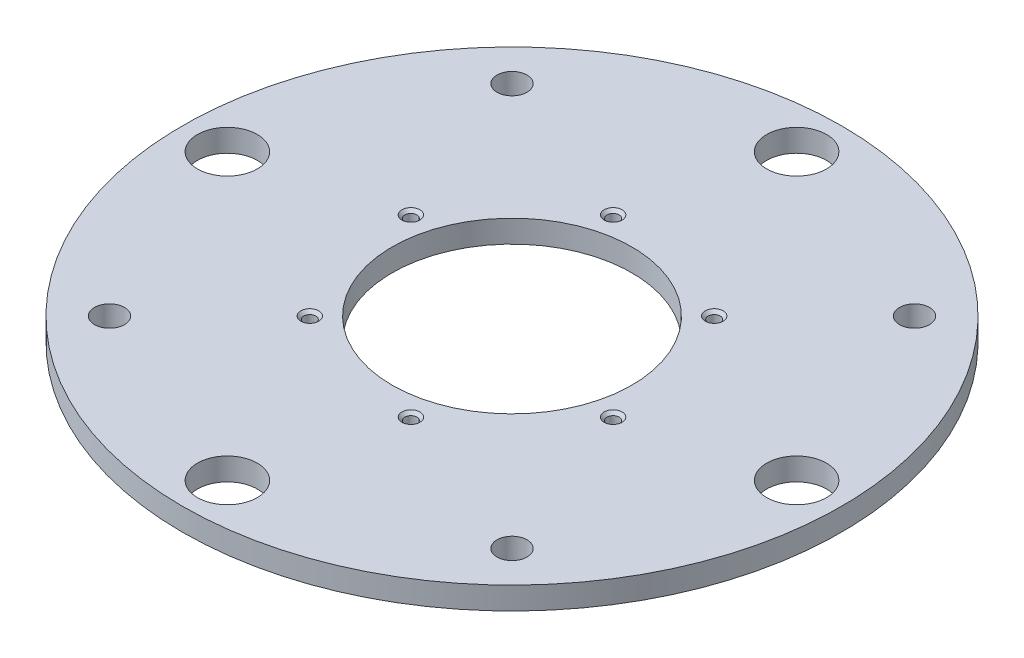
ISO-10303-21;
HEADER;
FILE_DESCRIPTION(('STEP AP214'),'2;1');
FILE_NAME('part.step','',(''),(''),'','','');
FILE_SCHEMA(('AUTOMOTIVE_DESIGN { 1 0 10303 214 1 1 1 1 }'));
ENDSEC;
DATA;
#1=APPLICATION_CONTEXT('core data for automotive mechanical design processes');
#2=APPLICATION_PROTOCOL_DEFINITION('international standard','automotive_design',2000,#1);
#3=PRODUCT_CONTEXT('',#1,'mechanical');
#4=PRODUCT('Part','Part','',(#3));
#5=PRODUCT_RELATED_PRODUCT_CATEGORY('part','',(#4));
#6=PRODUCT_DEFINITION_FORMATION('','',#4);
#7=PRODUCT_DEFINITION_CONTEXT('part definition',#1,'design');
#8=PRODUCT_DEFINITION('design','',#6,#7);
#9=PRODUCT_DEFINITION_SHAPE('','',#8);
#10=(LENGTH_UNIT() NAMED_UNIT(*) SI_UNIT(.MILLI.,.METRE.));
#11=(NAMED_UNIT(*) PLANE_ANGLE_UNIT() SI_UNIT($,.RADIAN.));
#12=(NAMED_UNIT(*) SI_UNIT($,.STERADIAN.) SOLID_ANGLE_UNIT());
#13=UNCERTAINTY_MEASURE_WITH_UNIT(LENGTH_MEASURE(1.E-05),#10,'distance_accuracy_value','');
#14=(GEOMETRIC_REPRESENTATION_CONTEXT(3) GLOBAL_UNCERTAINTY_ASSIGNED_CONTEXT((#13)) GLOBAL_UNIT_ASSIGNED_CONTEXT((#10,
#11,#12)) REPRESENTATION_CONTEXT('',''));
#15=CARTESIAN_POINT('',(0.,0.,0.));
#16=DIRECTION('',(0.,0.,1.));
#17=DIRECTION('',(1.,0.,0.));
#18=AXIS2_PLACEMENT_3D('',#15,#16,#17);
#19=CARTESIAN_POINT('',(0.,9.525,0.));
#20=DIRECTION('',(0.,1.,0.));
#21=DIRECTION('',(0.,0.,1.));
#22=AXIS2_PLACEMENT_3D('',#19,#20,#21);
#23=PLANE('',#22);
#24=CARTESIAN_POINT('',(-58.5454887757494,9.525,-15.6872164379448));
#25=DIRECTION('',(0.,1.,0.));
#26=DIRECTION('',(0.,0.,1.));
#27=AXIS2_PLACEMENT_3D('',#24,#25,#26);
#28=CIRCLE('',#27,3.81);
#29=CARTESIAN_POINT('',(-58.5454887757494,9.525,-11.8772164379448));
#30=VERTEX_POINT('',#29);
#31=EDGE_CURVE('E167',#30,#30,#28,.T.);
#32=ORIENTED_EDGE('',*,*,#31,.F.);
#33=EDGE_LOOP('',(#32));
#34=FACE_BOUND('',#33,.T.);
#35=CARTESIAN_POINT('',(-15.6872164379468,9.525,-58.5454887757503));
#36=DIRECTION('',(0.,1.,0.));
#37=DIRECTION('',(0.,0.,1.));
#38=AXIS2_PLACEMENT_3D('',#35,#36,#37);
#39=CIRCLE('',#38,3.81);
#40=CARTESIAN_POINT('',(-15.6872164379468,9.525,-54.7354887757503));
#41=VERTEX_POINT('',#40);
#42=EDGE_CURVE('E155',#41,#41,#39,.T.);
#43=ORIENTED_EDGE('',*,*,#42,.F.);
#44=EDGE_LOOP('',(#43));
#45=FACE_BOUND('',#44,.T.);
#46=CARTESIAN_POINT('',(42.8582723378026,9.525,-42.8582723378025));
#47=DIRECTION('',(0.,1.,0.));
#48=DIRECTION('',(0.,0.,1.));
#49=AXIS2_PLACEMENT_3D('',#46,#47,#48);
#50=CIRCLE('',#49,3.81);
#51=CARTESIAN_POINT('',(42.8582723378026,9.525,-39.0482723378025));
#52=VERTEX_POINT('',#51);
#53=EDGE_CURVE('E143',#52,#52,#50,.T.);
#54=ORIENTED_EDGE('',*,*,#53,.F.);
#55=EDGE_LOOP('',(#54));
#56=FACE_BOUND('',#55,.T.);
#57=CARTESIAN_POINT('',(58.5454887757501,9.525,15.6872164379478));
#58=DIRECTION('',(0.,1.,0.));
#59=DIRECTION('',(0.,0.,1.));
#60=AXIS2_PLACEMENT_3D('',#57,#58,#59);
#61=CIRCLE('',#60,3.81);
#62=CARTESIAN_POINT('',(58.5454887757501,9.525,19.4972164379478));
#63=VERTEX_POINT('',#62);
#64=EDGE_CURVE('E131',#63,#63,#61,.T.);
#65=ORIENTED_EDGE('',*,*,#64,.F.);
#66=EDGE_LOOP('',(#65));
#67=FACE_BOUND('',#66,.T.);
#68=CARTESIAN_POINT('',(15.6872164379472,9.525,58.5454887757502));
#69=DIRECTION('',(0.,1.,0.));
#70=DIRECTION('',(0.,0.,1.));
#71=AXIS2_PLACEMENT_3D('',#68,#69,#70);
#72=CIRCLE('',#71,3.81);
#73=CARTESIAN_POINT('',(15.6872164379472,9.525,62.3554887757502));
#74=VERTEX_POINT('',#73);
#75=EDGE_CURVE('E119',#74,#74,#72,.T.);
#76=ORIENTED_EDGE('',*,*,#75,.F.);
#77=EDGE_LOOP('',(#76));
#78=FACE_BOUND('',#77,.T.);
#79=CARTESIAN_POINT('',(-42.8582723378026,9.525,42.8582723378025));
#80=DIRECTION('',(0.,1.,0.));
#81=DIRECTION('',(0.,0.,1.));
#82=AXIS2_PLACEMENT_3D('',#79,#80,#81);
#83=CIRCLE('',#82,3.81);
#84=CARTESIAN_POINT('',(-42.8582723378026,9.525,46.6682723378025));
#85=VERTEX_POINT('',#84);
#86=EDGE_CURVE('E107',#85,#85,#83,.T.);
#87=ORIENTED_EDGE('',*,*,#86,.F.);
#88=EDGE_LOOP('',(#87));
#89=FACE_BOUND('',#88,.T.);
#90=CARTESIAN_POINT('',(-85.3124331501554,9.525,-85.3124331501519));
#91=DIRECTION('',(0.,1.,0.));
#92=DIRECTION('',(0.,0.,1.));
#93=AXIS2_PLACEMENT_3D('',#90,#91,#92);
#94=CIRCLE('',#93,6.34999999999999);
#95=CARTESIAN_POINT('',(-85.3124331501554,9.525,-78.962433150152));
#96=VERTEX_POINT('',#95);
#97=EDGE_CURVE('E57',#96,#96,#94,.T.);
#98=ORIENTED_EDGE('',*,*,#97,.F.);
#99=EDGE_LOOP('',(#98));
#100=FACE_BOUND('',#99,.T.);
#101=CARTESIAN_POINT('',(0.,9.525,-120.65));
#102=DIRECTION('',(0.,1.,0.));
#103=DIRECTION('',(0.,0.,1.));
#104=AXIS2_PLACEMENT_3D('',#101,#102,#103);
#105=CIRCLE('',#104,12.6746);
#106=CARTESIAN_POINT('',(0.,9.525,-107.9754));
#107=VERTEX_POINT('',#106);
#108=EDGE_CURVE('E94',#107,#107,#105,.T.);
#109=ORIENTED_EDGE('',*,*,#108,.F.);
#110=EDGE_LOOP('',(#109));
#111=FACE_BOUND('',#110,.T.);
#112=CARTESIAN_POINT('',(85.3124331501571,9.525,-85.3124331501568));
#113=DIRECTION('',(0.,1.,0.));
#114=DIRECTION('',(0.,0.,1.));
#115=AXIS2_PLACEMENT_3D('',#112,#113,#114);
#116=CIRCLE('',#115,6.34999999999999);
#117=CARTESIAN_POINT('',(85.3124331501571,9.525,-78.9624331501568));
#118=VERTEX_POINT('',#117);
#119=EDGE_CURVE('E88',#118,#118,#116,.T.);
#120=ORIENTED_EDGE('',*,*,#119,.F.);
#121=EDGE_LOOP('',(#120));
#122=FACE_BOUND('',#121,.T.);
#123=CARTESIAN_POINT('',(120.65,9.525,0.));
#124=DIRECTION('',(0.,1.,0.));
#125=DIRECTION('',(0.,0.,1.));
#126=AXIS2_PLACEMENT_3D('',#123,#124,#125);
#127=CIRCLE('',#126,12.6746);
#128=CARTESIAN_POINT('',(120.65,9.525,12.6746));
#129=VERTEX_POINT('',#128);
#130=EDGE_CURVE('E82',#129,#129,#127,.T.);
#131=ORIENTED_EDGE('',*,*,#130,.F.);
#132=EDGE_LOOP('',(#131));
#133=FACE_BOUND('',#132,.T.);
#134=CARTESIAN_POINT('',(85.312433150162,9.525,85.3124331501558));
#135=DIRECTION('',(0.,1.,0.));
#136=DIRECTION('',(0.,0.,1.));
#137=AXIS2_PLACEMENT_3D('',#134,#135,#136);
#138=CIRCLE('',#137,6.35000000000011);
#139=CARTESIAN_POINT('',(85.312433150162,9.525,91.6624331501559));
#140=VERTEX_POINT('',#139);
#141=EDGE_CURVE('E76',#140,#140,#138,.T.);
#142=ORIENTED_EDGE('',*,*,#141,.F.);
#143=EDGE_LOOP('',(#142));
#144=FACE_BOUND('',#143,.T.);
#145=CARTESIAN_POINT('',(0.,9.525,120.65));
#146=DIRECTION('',(0.,1.,0.));
#147=DIRECTION('',(0.,0.,1.));
#148=AXIS2_PLACEMENT_3D('',#145,#146,#147);
#149=CIRCLE('',#148,12.6746);
#150=CARTESIAN_POINT('',(0.,9.525,133.3246));
#151=VERTEX_POINT('',#150);
#152=EDGE_CURVE('E70',#151,#151,#149,.T.);
#153=ORIENTED_EDGE('',*,*,#152,.F.);
#154=EDGE_LOOP('',(#153));
#155=FACE_BOUND('',#154,.T.);
#156=CARTESIAN_POINT('',(-85.3124331501506,9.525,85.3124331501606));
#157=DIRECTION('',(0.,1.,0.));
#158=DIRECTION('',(0.,0.,1.));
#159=AXIS2_PLACEMENT_3D('',#156,#157,#158);
#160=CIRCLE('',#159,6.34999999999999);
#161=CARTESIAN_POINT('',(-85.3124331501506,9.525,91.6624331501606));
#162=VERTEX_POINT('',#161);
#163=EDGE_CURVE('E63',#162,#162,#160,.T.);
#164=ORIENTED_EDGE('',*,*,#163,.F.);
#165=EDGE_LOOP('',(#164));
#166=FACE_BOUND('',#165,.T.);
#167=CARTESIAN_POINT('',(-120.65,9.525,0.));
#168=DIRECTION('',(0.,1.,0.));
#169=DIRECTION('',(0.,0.,1.));
#170=AXIS2_PLACEMENT_3D('',#167,#168,#169);
#171=CIRCLE('',#170,12.6746);
#172=CARTESIAN_POINT('',(-120.65,9.525,12.6746));
#173=VERTEX_POINT('',#172);
#174=EDGE_CURVE('E54',#173,#173,#171,.T.);
#175=ORIENTED_EDGE('',*,*,#174,.F.);
#176=EDGE_LOOP('',(#175));
#177=FACE_BOUND('',#176,.T.);
#178=CARTESIAN_POINT('',(0.,9.525,0.));
#179=DIRECTION('',(0.,1.,0.));
#180=DIRECTION('',(0.,0.,1.));
#181=AXIS2_PLACEMENT_3D('',#178,#179,#180);
#182=CIRCLE('',#181,139.7);
#183=CARTESIAN_POINT('',(0.,9.525,139.7));
#184=VERTEX_POINT('',#183);
#185=EDGE_CURVE('E10',#184,#184,#182,.T.);
#186=ORIENTED_EDGE('',*,*,#185,.T.);
#187=EDGE_LOOP('',(#186));
#188=FACE_BOUND('',#187,.T.);
#189=CARTESIAN_POINT('',(0.,9.525,0.));
#190=DIRECTION('',(0.,1.,0.));
#191=DIRECTION('',(0.,0.,1.));
#192=AXIS2_PLACEMENT_3D('',#189,#190,#191);
#193=CIRCLE('',#192,50.8);
#194=CARTESIAN_POINT('',(0.,9.525,50.8));
#195=VERTEX_POINT('',#194);
#196=EDGE_CURVE('E46',#195,#195,#193,.T.);
#197=ORIENTED_EDGE('',*,*,#196,.F.);
#198=EDGE_LOOP('',(#197));
#199=FACE_BOUND('',#198,.T.);
#200=ADVANCED_FACE('F35',(#34,#45,#56,#67,#78,#89,#100,#111,#122,#133,#144,#155,#166,#177,#188,
#199),#23,.T.);
#201=CARTESIAN_POINT('',(0.,0.,0.));
#202=DIRECTION('',(0.,1.,0.));
#203=DIRECTION('',(0.,0.,1.));
#204=AXIS2_PLACEMENT_3D('',#201,#202,#203);
#205=PLANE('',#204);
#206=CARTESIAN_POINT('',(-58.5454887757494,0.,-15.6872164379448));
#207=DIRECTION('',(0.,1.,0.));
#208=DIRECTION('',(0.,0.,1.));
#209=AXIS2_PLACEMENT_3D('',#206,#207,#208);
#210=CIRCLE('',#209,3.80999999999999);
#211=CARTESIAN_POINT('',(-58.5454887757494,0.,-11.8772164379448));
#212=VERTEX_POINT('',#211);
#213=EDGE_CURVE('E170',#212,#212,#210,.T.);
#214=ORIENTED_EDGE('',*,*,#213,.T.);
#215=EDGE_LOOP('',(#214));
#216=FACE_BOUND('',#215,.T.);
#217=CARTESIAN_POINT('',(-15.6872164379468,0.,-58.5454887757503));
#218=DIRECTION('',(0.,1.,0.));
#219=DIRECTION('',(0.,0.,1.));
#220=AXIS2_PLACEMENT_3D('',#217,#218,#219);
#221=CIRCLE('',#220,3.81);
#222=CARTESIAN_POINT('',(-15.6872164379468,0.,-54.7354887757503));
#223=VERTEX_POINT('',#222);
#224=EDGE_CURVE('E158',#223,#223,#221,.T.);
#225=ORIENTED_EDGE('',*,*,#224,.T.);
#226=EDGE_LOOP('',(#225));
#227=FACE_BOUND('',#226,.T.);
#228=CARTESIAN_POINT('',(42.8582723378026,0.,-42.8582723378025));
#229=DIRECTION('',(0.,1.,0.));
#230=DIRECTION('',(0.,0.,1.));
#231=AXIS2_PLACEMENT_3D('',#228,#229,#230);
#232=CIRCLE('',#231,3.81);
#233=CARTESIAN_POINT('',(42.8582723378026,0.,-39.0482723378025));
#234=VERTEX_POINT('',#233);
#235=EDGE_CURVE('E146',#234,#234,#232,.T.);
#236=ORIENTED_EDGE('',*,*,#235,.T.);
#237=EDGE_LOOP('',(#236));
#238=FACE_BOUND('',#237,.T.);
#239=CARTESIAN_POINT('',(58.5454887757501,0.,15.6872164379478));
#240=DIRECTION('',(0.,1.,0.));
#241=DIRECTION('',(0.,0.,1.));
#242=AXIS2_PLACEMENT_3D('',#239,#240,#241);
#243=CIRCLE('',#242,3.80999999999999);
#244=CARTESIAN_POINT('',(58.5454887757501,0.,19.4972164379478));
#245=VERTEX_POINT('',#244);
#246=EDGE_CURVE('E134',#245,#245,#243,.T.);
#247=ORIENTED_EDGE('',*,*,#246,.T.);
#248=EDGE_LOOP('',(#247));
#249=FACE_BOUND('',#248,.T.);
#250=CARTESIAN_POINT('',(15.6872164379472,0.,58.5454887757502));
#251=DIRECTION('',(0.,1.,0.));
#252=DIRECTION('',(0.,0.,1.));
#253=AXIS2_PLACEMENT_3D('',#250,#251,#252);
#254=CIRCLE('',#253,3.81);
#255=CARTESIAN_POINT('',(15.6872164379472,0.,62.3554887757502));
#256=VERTEX_POINT('',#255);
#257=EDGE_CURVE('E122',#256,#256,#254,.T.);
#258=ORIENTED_EDGE('',*,*,#257,.T.);
#259=EDGE_LOOP('',(#258));
#260=FACE_BOUND('',#259,.T.);
#261=CARTESIAN_POINT('',(-42.8582723378026,0.,42.8582723378025));
#262=DIRECTION('',(0.,1.,0.));
#263=DIRECTION('',(0.,0.,1.));
#264=AXIS2_PLACEMENT_3D('',#261,#262,#263);
#265=CIRCLE('',#264,3.81);
#266=CARTESIAN_POINT('',(-42.8582723378026,0.,46.6682723378025));
#267=VERTEX_POINT('',#266);
#268=EDGE_CURVE('E110',#267,#267,#265,.T.);
#269=ORIENTED_EDGE('',*,*,#268,.T.);
#270=EDGE_LOOP('',(#269));
#271=FACE_BOUND('',#270,.T.);
#272=CARTESIAN_POINT('',(-85.3124331501554,0.,-85.3124331501519));
#273=DIRECTION('',(0.,1.,0.));
#274=DIRECTION('',(0.,0.,1.));
#275=AXIS2_PLACEMENT_3D('',#272,#273,#274);
#276=CIRCLE('',#275,6.34999999999999);
#277=CARTESIAN_POINT('',(-85.3124331501554,0.,-78.962433150152));
#278=VERTEX_POINT('',#277);
#279=EDGE_CURVE('E97',#278,#278,#276,.T.);
#280=ORIENTED_EDGE('',*,*,#279,.T.);
#281=EDGE_LOOP('',(#280));
#282=FACE_BOUND('',#281,.T.);
#283=CARTESIAN_POINT('',(0.,0.,-120.65));
#284=DIRECTION('',(0.,1.,0.));
#285=DIRECTION('',(0.,0.,1.));
#286=AXIS2_PLACEMENT_3D('',#283,#284,#285);
#287=CIRCLE('',#286,12.6746);
#288=CARTESIAN_POINT('',(0.,0.,-107.9754));
#289=VERTEX_POINT('',#288);
#290=EDGE_CURVE('E91',#289,#289,#287,.T.);
#291=ORIENTED_EDGE('',*,*,#290,.T.);
#292=EDGE_LOOP('',(#291));
#293=FACE_BOUND('',#292,.T.);
#294=CARTESIAN_POINT('',(85.3124331501571,0.,-85.3124331501568));
#295=DIRECTION('',(0.,1.,0.));
#296=DIRECTION('',(0.,0.,1.));
#297=AXIS2_PLACEMENT_3D('',#294,#295,#296);
#298=CIRCLE('',#297,6.34999999999999);
#299=CARTESIAN_POINT('',(85.3124331501571,0.,-78.9624331501568));
#300=VERTEX_POINT('',#299);
#301=EDGE_CURVE('E85',#300,#300,#298,.T.);
#302=ORIENTED_EDGE('',*,*,#301,.T.);
#303=EDGE_LOOP('',(#302));
#304=FACE_BOUND('',#303,.T.);
#305=CARTESIAN_POINT('',(120.65,0.,0.));
#306=DIRECTION('',(0.,1.,0.));
#307=DIRECTION('',(0.,0.,1.));
#308=AXIS2_PLACEMENT_3D('',#305,#306,#307);
#309=CIRCLE('',#308,12.6746);
#310=CARTESIAN_POINT('',(120.65,0.,12.6746));
#311=VERTEX_POINT('',#310);
#312=EDGE_CURVE('E79',#311,#311,#309,.T.);
#313=ORIENTED_EDGE('',*,*,#312,.T.);
#314=EDGE_LOOP('',(#313));
#315=FACE_BOUND('',#314,.T.);
#316=CARTESIAN_POINT('',(85.312433150162,0.,85.3124331501558));
#317=DIRECTION('',(0.,1.,0.));
#318=DIRECTION('',(0.,0.,1.));
#319=AXIS2_PLACEMENT_3D('',#316,#317,#318);
#320=CIRCLE('',#319,6.35000000000011);
#321=CARTESIAN_POINT('',(85.312433150162,0.,91.6624331501559));
#322=VERTEX_POINT('',#321);
#323=EDGE_CURVE('E73',#322,#322,#320,.T.);
#324=ORIENTED_EDGE('',*,*,#323,.T.);
#325=EDGE_LOOP('',(#324));
#326=FACE_BOUND('',#325,.T.);
#327=CARTESIAN_POINT('',(0.,0.,120.65));
#328=DIRECTION('',(0.,1.,0.));
#329=DIRECTION('',(0.,0.,1.));
#330=AXIS2_PLACEMENT_3D('',#327,#328,#329);
#331=CIRCLE('',#330,12.6746);
#332=CARTESIAN_POINT('',(0.,0.,133.3246));
#333=VERTEX_POINT('',#332);
#334=EDGE_CURVE('E67',#333,#333,#331,.T.);
#335=ORIENTED_EDGE('',*,*,#334,.T.);
#336=EDGE_LOOP('',(#335));
#337=FACE_BOUND('',#336,.T.);
#338=CARTESIAN_POINT('',(-85.3124331501506,0.,85.3124331501606));
#339=DIRECTION('',(0.,1.,0.));
#340=DIRECTION('',(0.,0.,1.));
#341=AXIS2_PLACEMENT_3D('',#338,#339,#340);
#342=CIRCLE('',#341,6.34999999999999);
#343=CARTESIAN_POINT('',(-85.3124331501506,0.,91.6624331501606));
#344=VERTEX_POINT('',#343);
#345=EDGE_CURVE('E60',#344,#344,#342,.T.);
#346=ORIENTED_EDGE('',*,*,#345,.T.);
#347=EDGE_LOOP('',(#346));
#348=FACE_BOUND('',#347,.T.);
#349=CARTESIAN_POINT('',(-120.65,0.,0.));
#350=DIRECTION('',(0.,1.,0.));
#351=DIRECTION('',(0.,0.,1.));
#352=AXIS2_PLACEMENT_3D('',#349,#350,#351);
#353=CIRCLE('',#352,12.6746);
#354=CARTESIAN_POINT('',(-120.65,0.,12.6746));
#355=VERTEX_POINT('',#354);
#356=EDGE_CURVE('E51',#355,#355,#353,.T.);
#357=ORIENTED_EDGE('',*,*,#356,.T.);
#358=EDGE_LOOP('',(#357));
#359=FACE_BOUND('',#358,.T.);
#360=CARTESIAN_POINT('',(0.,0.,0.));
#361=DIRECTION('',(0.,1.,0.));
#362=DIRECTION('',(0.,0.,1.));
#363=AXIS2_PLACEMENT_3D('',#360,#361,#362);
#364=CIRCLE('',#363,139.7);
#365=CARTESIAN_POINT('',(0.,0.,139.7));
#366=VERTEX_POINT('',#365);
#367=EDGE_CURVE('E39',#366,#366,#364,.T.);
#368=ORIENTED_EDGE('',*,*,#367,.F.);
#369=EDGE_LOOP('',(#368));
#370=FACE_BOUND('',#369,.T.);
#371=CARTESIAN_POINT('',(0.,0.,0.));
#372=DIRECTION('',(0.,1.,0.));
#373=DIRECTION('',(0.,0.,1.));
#374=AXIS2_PLACEMENT_3D('',#371,#372,#373);
#375=CIRCLE('',#374,50.8);
#376=CARTESIAN_POINT('',(0.,0.,50.8));
#377=VERTEX_POINT('',#376);
#378=EDGE_CURVE('E48',#377,#377,#375,.T.);
#379=ORIENTED_EDGE('',*,*,#378,.T.);
#380=EDGE_LOOP('',(#379));
#381=FACE_BOUND('',#380,.T.);
#382=ADVANCED_FACE('F174',(#216,#227,#238,#249,#260,#271,#282,#293,#304,#315,#326,#337,#348,
#359,#370,#381),#205,.F.);
#383=CARTESIAN_POINT('',(0.,9.525,0.));
#384=DIRECTION('',(0.,-1.,0.));
#385=DIRECTION('',(0.,0.,-1.));
#386=AXIS2_PLACEMENT_3D('',#383,#384,#385);
#387=CYLINDRICAL_SURFACE('',#386,139.7);
#388=ORIENTED_EDGE('',*,*,#185,.F.);
#389=EDGE_LOOP('',(#388));
#390=FACE_BOUND('',#389,.T.);
#391=ORIENTED_EDGE('',*,*,#367,.T.);
#392=EDGE_LOOP('',(#391));
#393=FACE_BOUND('',#392,.T.);
#394=ADVANCED_FACE('F37',(#390,#393),#387,.T.);
#395=CARTESIAN_POINT('',(0.,9.525,0.));
#396=DIRECTION('',(0.,-1.,0.));
#397=DIRECTION('',(0.,0.,-1.));
#398=AXIS2_PLACEMENT_3D('',#395,#396,#397);
#399=CYLINDRICAL_SURFACE('',#398,50.8);
#400=ORIENTED_EDGE('',*,*,#196,.T.);
#401=EDGE_LOOP('',(#400));
#402=FACE_BOUND('',#401,.T.);
#403=ORIENTED_EDGE('',*,*,#378,.F.);
#404=EDGE_LOOP('',(#403));
#405=FACE_BOUND('',#404,.T.);
#406=ADVANCED_FACE('F227',(#402,#405),#399,.F.);
#407=CARTESIAN_POINT('',(-120.65,0.,0.));
#408=DIRECTION('',(0.,1.,0.));
#409=DIRECTION('',(0.,0.,1.));
#410=AXIS2_PLACEMENT_3D('',#407,#408,#409);
#411=CYLINDRICAL_SURFACE('',#410,12.6746);
#412=ORIENTED_EDGE('',*,*,#356,.F.);
#413=EDGE_LOOP('',(#412));
#414=FACE_BOUND('',#413,.T.);
#415=ORIENTED_EDGE('',*,*,#174,.T.);
#416=EDGE_LOOP('',(#415));
#417=FACE_BOUND('',#416,.T.);
#418=ADVANCED_FACE('F230',(#414,#417),#411,.F.);
#419=CARTESIAN_POINT('',(-85.3124331501506,0.,85.3124331501606));
#420=DIRECTION('',(0.,1.,0.));
#421=DIRECTION('',(0.,0.,1.));
#422=AXIS2_PLACEMENT_3D('',#419,#420,#421);
#423=CYLINDRICAL_SURFACE('',#422,6.34999999999999);
#424=ORIENTED_EDGE('',*,*,#345,.F.);
#425=EDGE_LOOP('',(#424));
#426=FACE_BOUND('',#425,.T.);
#427=ORIENTED_EDGE('',*,*,#163,.T.);
#428=EDGE_LOOP('',(#427));
#429=FACE_BOUND('',#428,.T.);
#430=ADVANCED_FACE('F242',(#426,#429),#423,.F.);
#431=CARTESIAN_POINT('',(0.,0.,120.65));
#432=DIRECTION('',(0.,1.,0.));
#433=DIRECTION('',(0.,0.,1.));
#434=AXIS2_PLACEMENT_3D('',#431,#432,#433);
#435=CYLINDRICAL_SURFACE('',#434,12.6746);
#436=ORIENTED_EDGE('',*,*,#334,.F.);
#437=EDGE_LOOP('',(#436));
#438=FACE_BOUND('',#437,.T.);
#439=ORIENTED_EDGE('',*,*,#152,.T.);
#440=EDGE_LOOP('',(#439));
#441=FACE_BOUND('',#440,.T.);
#442=ADVANCED_FACE('F246',(#438,#441),#435,.F.);
#443=CARTESIAN_POINT('',(85.312433150162,0.,85.3124331501558));
#444=DIRECTION('',(0.,1.,0.));
#445=DIRECTION('',(0.,0.,1.));
#446=AXIS2_PLACEMENT_3D('',#443,#444,#445);
#447=CYLINDRICAL_SURFACE('',#446,6.35000000000011);
#448=ORIENTED_EDGE('',*,*,#323,.F.);
#449=EDGE_LOOP('',(#448));
#450=FACE_BOUND('',#449,.T.);
#451=ORIENTED_EDGE('',*,*,#141,.T.);
#452=EDGE_LOOP('',(#451));
#453=FACE_BOUND('',#452,.T.);
#454=ADVANCED_FACE('F250',(#450,#453),#447,.F.);
#455=CARTESIAN_POINT('',(120.65,0.,0.));
#456=DIRECTION('',(0.,1.,0.));
#457=DIRECTION('',(0.,0.,1.));
#458=AXIS2_PLACEMENT_3D('',#455,#456,#457);
#459=CYLINDRICAL_SURFACE('',#458,12.6746);
#460=ORIENTED_EDGE('',*,*,#312,.F.);
#461=EDGE_LOOP('',(#460));
#462=FACE_BOUND('',#461,.T.);
#463=ORIENTED_EDGE('',*,*,#130,.T.);
#464=EDGE_LOOP('',(#463));
#465=FACE_BOUND('',#464,.T.);
#466=ADVANCED_FACE('F254',(#462,#465),#459,.F.);
#467=CARTESIAN_POINT('',(85.3124331501571,0.,-85.3124331501568));
#468=DIRECTION('',(0.,1.,0.));
#469=DIRECTION('',(0.,0.,1.));
#470=AXIS2_PLACEMENT_3D('',#467,#468,#469);
#471=CYLINDRICAL_SURFACE('',#470,6.34999999999999);
#472=ORIENTED_EDGE('',*,*,#301,.F.);
#473=EDGE_LOOP('',(#472));
#474=FACE_BOUND('',#473,.T.);
#475=ORIENTED_EDGE('',*,*,#119,.T.);
#476=EDGE_LOOP('',(#475));
#477=FACE_BOUND('',#476,.T.);
#478=ADVANCED_FACE('F258',(#474,#477),#471,.F.);
#479=CARTESIAN_POINT('',(0.,0.,-120.65));
#480=DIRECTION('',(0.,1.,0.));
#481=DIRECTION('',(0.,0.,1.));
#482=AXIS2_PLACEMENT_3D('',#479,#480,#481);
#483=CYLINDRICAL_SURFACE('',#482,12.6746);
#484=ORIENTED_EDGE('',*,*,#290,.F.);
#485=EDGE_LOOP('',(#484));
#486=FACE_BOUND('',#485,.T.);
#487=ORIENTED_EDGE('',*,*,#108,.T.);
#488=EDGE_LOOP('',(#487));
#489=FACE_BOUND('',#488,.T.);
#490=ADVANCED_FACE('F262',(#486,#489),#483,.F.);
#491=CARTESIAN_POINT('',(-85.3124331501554,0.,-85.3124331501519));
#492=DIRECTION('',(0.,1.,0.));
#493=DIRECTION('',(0.,0.,1.));
#494=AXIS2_PLACEMENT_3D('',#491,#492,#493);
#495=CYLINDRICAL_SURFACE('',#494,6.34999999999999);
#496=ORIENTED_EDGE('',*,*,#279,.F.);
#497=EDGE_LOOP('',(#496));
#498=FACE_BOUND('',#497,.T.);
#499=ORIENTED_EDGE('',*,*,#97,.T.);
#500=EDGE_LOOP('',(#499));
#501=FACE_BOUND('',#500,.T.);
#502=ADVANCED_FACE('F266',(#498,#501),#495,.F.);
#503=CARTESIAN_POINT('',(-42.8582723378026,1.2573,42.8582723378025));
#504=DIRECTION('',(0.,-1.,0.));
#505=DIRECTION('',(0.,0.,-1.));
#506=AXIS2_PLACEMENT_3D('',#503,#504,#505);
#507=CONICAL_SURFACE('',#506,2.5527,0.785398163397448);
#508=ORIENTED_EDGE('',*,*,#268,.F.);
#509=EDGE_LOOP('',(#508));
#510=FACE_BOUND('',#509,.T.);
#511=CARTESIAN_POINT('',(-42.8582723378026,1.2573,42.8582723378025));
#512=DIRECTION('',(0.,1.,0.));
#513=DIRECTION('',(0.,0.,1.));
#514=AXIS2_PLACEMENT_3D('',#511,#512,#513);
#515=CIRCLE('',#514,2.5527);
#516=CARTESIAN_POINT('',(-42.8582723378026,1.2573,45.4109723378025));
#517=VERTEX_POINT('',#516);
#518=EDGE_CURVE('E64',#517,#517,#515,.T.);
#519=ORIENTED_EDGE('',*,*,#518,.T.);
#520=EDGE_LOOP('',(#519));
#521=FACE_BOUND('',#520,.T.);
#522=ADVANCED_FACE('F270',(#510,#521),#507,.F.);
#523=CARTESIAN_POINT('',(-42.8582723378026,9.525,42.8582723378025));
#524=DIRECTION('',(0.,1.,0.));
#525=DIRECTION('',(0.,0.,1.));
#526=AXIS2_PLACEMENT_3D('',#523,#524,#525);
#527=CYLINDRICAL_SURFACE('',#526,2.5527);
#528=ORIENTED_EDGE('',*,*,#518,.F.);
#529=EDGE_LOOP('',(#528));
#530=FACE_BOUND('',#529,.T.);
#531=CARTESIAN_POINT('',(-42.8582723378026,8.2677,42.8582723378025));
#532=DIRECTION('',(0.,1.,0.));
#533=DIRECTION('',(0.,0.,1.));
#534=AXIS2_PLACEMENT_3D('',#531,#532,#533);
#535=CIRCLE('',#534,2.5527);
#536=CARTESIAN_POINT('',(-42.8582723378026,8.2677,45.4109723378025));
#537=VERTEX_POINT('',#536);
#538=EDGE_CURVE('E104',#537,#537,#535,.T.);
#539=ORIENTED_EDGE('',*,*,#538,.T.);
#540=EDGE_LOOP('',(#539));
#541=FACE_BOUND('',#540,.T.);
#542=ADVANCED_FACE('F274',(#530,#541),#527,.F.);
#543=CARTESIAN_POINT('',(-42.8582723378026,9.525,42.8582723378025));
#544=DIRECTION('',(0.,1.,0.));
#545=DIRECTION('',(0.,0.,1.));
#546=AXIS2_PLACEMENT_3D('',#543,#544,#545);
#547=CONICAL_SURFACE('',#546,3.81,0.78539816339745);
#548=ORIENTED_EDGE('',*,*,#538,.F.);
#549=EDGE_LOOP('',(#548));
#550=FACE_BOUND('',#549,.T.);
#551=ORIENTED_EDGE('',*,*,#86,.T.);
#552=EDGE_LOOP('',(#551));
#553=FACE_BOUND('',#552,.T.);
#554=ADVANCED_FACE('F278',(#550,#553),#547,.F.);
#555=CARTESIAN_POINT('',(15.6872164379472,1.2573,58.5454887757502));
#556=DIRECTION('',(0.,-1.,0.));
#557=DIRECTION('',(0.,0.,-1.));
#558=AXIS2_PLACEMENT_3D('',#555,#556,#557);
#559=CONICAL_SURFACE('',#558,2.5527,0.785398163397447);
#560=ORIENTED_EDGE('',*,*,#257,.F.);
#561=EDGE_LOOP('',(#560));
#562=FACE_BOUND('',#561,.T.);
#563=CARTESIAN_POINT('',(15.6872164379472,1.2573,58.5454887757502));
#564=DIRECTION('',(0.,1.,0.));
#565=DIRECTION('',(0.,0.,1.));
#566=AXIS2_PLACEMENT_3D('',#563,#564,#565);
#567=CIRCLE('',#566,2.5527);
#568=CARTESIAN_POINT('',(15.6872164379472,1.2573,61.0981887757502));
#569=VERTEX_POINT('',#568);
#570=EDGE_CURVE('E113',#569,#569,#567,.T.);
#571=ORIENTED_EDGE('',*,*,#570,.T.);
#572=EDGE_LOOP('',(#571));
#573=FACE_BOUND('',#572,.T.);
#574=ADVANCED_FACE('F282',(#562,#573),#559,.F.);
#575=CARTESIAN_POINT('',(15.6872164379472,9.525,58.5454887757502));
#576=DIRECTION('',(0.,1.,0.));
#577=DIRECTION('',(0.,0.,1.));
#578=AXIS2_PLACEMENT_3D('',#575,#576,#577);
#579=CYLINDRICAL_SURFACE('',#578,2.5527);
#580=ORIENTED_EDGE('',*,*,#570,.F.);
#581=EDGE_LOOP('',(#580));
#582=FACE_BOUND('',#581,.T.);
#583=CARTESIAN_POINT('',(15.6872164379472,8.2677,58.5454887757502));
#584=DIRECTION('',(0.,1.,0.));
#585=DIRECTION('',(0.,0.,1.));
#586=AXIS2_PLACEMENT_3D('',#583,#584,#585);
#587=CIRCLE('',#586,2.5527);
#588=CARTESIAN_POINT('',(15.6872164379472,8.2677,61.0981887757502));
#589=VERTEX_POINT('',#588);
#590=EDGE_CURVE('E116',#589,#589,#587,.T.);
#591=ORIENTED_EDGE('',*,*,#590,.T.);
#592=EDGE_LOOP('',(#591));
#593=FACE_BOUND('',#592,.T.);
#594=ADVANCED_FACE('F286',(#582,#593),#579,.F.);
#595=CARTESIAN_POINT('',(15.6872164379472,9.525,58.5454887757502));
#596=DIRECTION('',(0.,1.,0.));
#597=DIRECTION('',(0.,0.,1.));
#598=AXIS2_PLACEMENT_3D('',#595,#596,#597);
#599=CONICAL_SURFACE('',#598,3.81,0.785398163397448);
#600=ORIENTED_EDGE('',*,*,#590,.F.);
#601=EDGE_LOOP('',(#600));
#602=FACE_BOUND('',#601,.T.);
#603=ORIENTED_EDGE('',*,*,#75,.T.);
#604=EDGE_LOOP('',(#603));
#605=FACE_BOUND('',#604,.T.);
#606=ADVANCED_FACE('F290',(#602,#605),#599,.F.);
#607=CARTESIAN_POINT('',(58.5454887757501,1.2573,15.6872164379478));
#608=DIRECTION('',(0.,-1.,0.));
#609=DIRECTION('',(0.,0.,-1.));
#610=AXIS2_PLACEMENT_3D('',#607,#608,#609);
#611=CONICAL_SURFACE('',#610,2.5527,0.785398163397446);
#612=ORIENTED_EDGE('',*,*,#246,.F.);
#613=EDGE_LOOP('',(#612));
#614=FACE_BOUND('',#613,.T.);
#615=CARTESIAN_POINT('',(58.5454887757501,1.2573,15.6872164379478));
#616=DIRECTION('',(0.,1.,0.));
#617=DIRECTION('',(0.,0.,1.));
#618=AXIS2_PLACEMENT_3D('',#615,#616,#617);
#619=CIRCLE('',#618,2.5527);
#620=CARTESIAN_POINT('',(58.5454887757501,1.2573,18.2399164379478));
#621=VERTEX_POINT('',#620);
#622=EDGE_CURVE('E125',#621,#621,#619,.T.);
#623=ORIENTED_EDGE('',*,*,#622,.T.);
#624=EDGE_LOOP('',(#623));
#625=FACE_BOUND('',#624,.T.);
#626=ADVANCED_FACE('F294',(#614,#625),#611,.F.);
#627=CARTESIAN_POINT('',(58.5454887757501,9.525,15.6872164379478));
#628=DIRECTION('',(0.,1.,0.));
#629=DIRECTION('',(0.,0.,1.));
#630=AXIS2_PLACEMENT_3D('',#627,#628,#629);
#631=CYLINDRICAL_SURFACE('',#630,2.5527);
#632=ORIENTED_EDGE('',*,*,#622,.F.);
#633=EDGE_LOOP('',(#632));
#634=FACE_BOUND('',#633,.T.);
#635=CARTESIAN_POINT('',(58.5454887757501,8.2677,15.6872164379478));
#636=DIRECTION('',(0.,1.,0.));
#637=DIRECTION('',(0.,0.,1.));
#638=AXIS2_PLACEMENT_3D('',#635,#636,#637);
#639=CIRCLE('',#638,2.5527);
#640=CARTESIAN_POINT('',(58.5454887757501,8.2677,18.2399164379478));
#641=VERTEX_POINT('',#640);
#642=EDGE_CURVE('E128',#641,#641,#639,.T.);
#643=ORIENTED_EDGE('',*,*,#642,.T.);
#644=EDGE_LOOP('',(#643));
#645=FACE_BOUND('',#644,.T.);
#646=ADVANCED_FACE('F298',(#634,#645),#631,.F.);
#647=CARTESIAN_POINT('',(58.5454887757501,9.525,15.6872164379478));
#648=DIRECTION('',(0.,1.,0.));
#649=DIRECTION('',(0.,0.,1.));
#650=AXIS2_PLACEMENT_3D('',#647,#648,#649);
#651=CONICAL_SURFACE('',#650,3.81,0.78539816339745);
#652=ORIENTED_EDGE('',*,*,#642,.F.);
#653=EDGE_LOOP('',(#652));
#654=FACE_BOUND('',#653,.T.);
#655=ORIENTED_EDGE('',*,*,#64,.T.);
#656=EDGE_LOOP('',(#655));
#657=FACE_BOUND('',#656,.T.);
#658=ADVANCED_FACE('F302',(#654,#657),#651,.F.);
#659=CARTESIAN_POINT('',(42.8582723378026,1.2573,-42.8582723378025));
#660=DIRECTION('',(0.,-1.,0.));
#661=DIRECTION('',(0.,0.,-1.));
#662=AXIS2_PLACEMENT_3D('',#659,#660,#661);
#663=CONICAL_SURFACE('',#662,2.5527,0.785398163397448);
#664=ORIENTED_EDGE('',*,*,#235,.F.);
#665=EDGE_LOOP('',(#664));
#666=FACE_BOUND('',#665,.T.);
#667=CARTESIAN_POINT('',(42.8582723378026,1.2573,-42.8582723378025));
#668=DIRECTION('',(0.,1.,0.));
#669=DIRECTION('',(0.,0.,1.));
#670=AXIS2_PLACEMENT_3D('',#667,#668,#669);
#671=CIRCLE('',#670,2.5527);
#672=CARTESIAN_POINT('',(42.8582723378026,1.2573,-40.3055723378025));
#673=VERTEX_POINT('',#672);
#674=EDGE_CURVE('E137',#673,#673,#671,.T.);
#675=ORIENTED_EDGE('',*,*,#674,.T.);
#676=EDGE_LOOP('',(#675));
#677=FACE_BOUND('',#676,.T.);
#678=ADVANCED_FACE('F306',(#666,#677),#663,.F.);
#679=CARTESIAN_POINT('',(42.8582723378026,9.525,-42.8582723378025));
#680=DIRECTION('',(0.,1.,0.));
#681=DIRECTION('',(0.,0.,1.));
#682=AXIS2_PLACEMENT_3D('',#679,#680,#681);
#683=CYLINDRICAL_SURFACE('',#682,2.5527);
#684=ORIENTED_EDGE('',*,*,#674,.F.);
#685=EDGE_LOOP('',(#684));
#686=FACE_BOUND('',#685,.T.);
#687=CARTESIAN_POINT('',(42.8582723378026,8.2677,-42.8582723378025));
#688=DIRECTION('',(0.,1.,0.));
#689=DIRECTION('',(0.,0.,1.));
#690=AXIS2_PLACEMENT_3D('',#687,#688,#689);
#691=CIRCLE('',#690,2.5527);
#692=CARTESIAN_POINT('',(42.8582723378026,8.2677,-40.3055723378025));
#693=VERTEX_POINT('',#692);
#694=EDGE_CURVE('E140',#693,#693,#691,.T.);
#695=ORIENTED_EDGE('',*,*,#694,.T.);
#696=EDGE_LOOP('',(#695));
#697=FACE_BOUND('',#696,.T.);
#698=ADVANCED_FACE('F310',(#686,#697),#683,.F.);
#699=CARTESIAN_POINT('',(42.8582723378026,9.525,-42.8582723378025));
#700=DIRECTION('',(0.,1.,0.));
#701=DIRECTION('',(0.,0.,1.));
#702=AXIS2_PLACEMENT_3D('',#699,#700,#701);
#703=CONICAL_SURFACE('',#702,3.81,0.78539816339745);
#704=ORIENTED_EDGE('',*,*,#694,.F.);
#705=EDGE_LOOP('',(#704));
#706=FACE_BOUND('',#705,.T.);
#707=ORIENTED_EDGE('',*,*,#53,.T.);
#708=EDGE_LOOP('',(#707));
#709=FACE_BOUND('',#708,.T.);
#710=ADVANCED_FACE('F314',(#706,#709),#703,.F.);
#711=CARTESIAN_POINT('',(-15.6872164379468,1.2573,-58.5454887757503));
#712=DIRECTION('',(0.,-1.,0.));
#713=DIRECTION('',(0.,0.,-1.));
#714=AXIS2_PLACEMENT_3D('',#711,#712,#713);
#715=CONICAL_SURFACE('',#714,2.5527,0.785398163397447);
#716=ORIENTED_EDGE('',*,*,#224,.F.);
#717=EDGE_LOOP('',(#716));
#718=FACE_BOUND('',#717,.T.);
#719=CARTESIAN_POINT('',(-15.6872164379468,1.2573,-58.5454887757503));
#720=DIRECTION('',(0.,1.,0.));
#721=DIRECTION('',(0.,0.,1.));
#722=AXIS2_PLACEMENT_3D('',#719,#720,#721);
#723=CIRCLE('',#722,2.5527);
#724=CARTESIAN_POINT('',(-15.6872164379468,1.2573,-55.9927887757503));
#725=VERTEX_POINT('',#724);
#726=EDGE_CURVE('E149',#725,#725,#723,.T.);
#727=ORIENTED_EDGE('',*,*,#726,.T.);
#728=EDGE_LOOP('',(#727));
#729=FACE_BOUND('',#728,.T.);
#730=ADVANCED_FACE('F318',(#718,#729),#715,.F.);
#731=CARTESIAN_POINT('',(-15.6872164379468,9.525,-58.5454887757503));
#732=DIRECTION('',(0.,1.,0.));
#733=DIRECTION('',(0.,0.,1.));
#734=AXIS2_PLACEMENT_3D('',#731,#732,#733);
#735=CYLINDRICAL_SURFACE('',#734,2.5527);
#736=ORIENTED_EDGE('',*,*,#726,.F.);
#737=EDGE_LOOP('',(#736));
#738=FACE_BOUND('',#737,.T.);
#739=CARTESIAN_POINT('',(-15.6872164379468,8.2677,-58.5454887757503));
#740=DIRECTION('',(0.,1.,0.));
#741=DIRECTION('',(0.,0.,1.));
#742=AXIS2_PLACEMENT_3D('',#739,#740,#741);
#743=CIRCLE('',#742,2.5527);
#744=CARTESIAN_POINT('',(-15.6872164379468,8.2677,-55.9927887757503));
#745=VERTEX_POINT('',#744);
#746=EDGE_CURVE('E152',#745,#745,#743,.T.);
#747=ORIENTED_EDGE('',*,*,#746,.T.);
#748=EDGE_LOOP('',(#747));
#749=FACE_BOUND('',#748,.T.);
#750=ADVANCED_FACE('F322',(#738,#749),#735,.F.);
#751=CARTESIAN_POINT('',(-15.6872164379468,9.525,-58.5454887757503));
#752=DIRECTION('',(0.,1.,0.));
#753=DIRECTION('',(0.,0.,1.));
#754=AXIS2_PLACEMENT_3D('',#751,#752,#753);
#755=CONICAL_SURFACE('',#754,3.81,0.785398163397448);
#756=ORIENTED_EDGE('',*,*,#746,.F.);
#757=EDGE_LOOP('',(#756));
#758=FACE_BOUND('',#757,.T.);
#759=ORIENTED_EDGE('',*,*,#42,.T.);
#760=EDGE_LOOP('',(#759));
#761=FACE_BOUND('',#760,.T.);
#762=ADVANCED_FACE('F181',(#758,#761),#755,.F.);
#763=CARTESIAN_POINT('',(-58.5454887757494,1.2573,-15.6872164379448));
#764=DIRECTION('',(0.,-1.,0.));
#765=DIRECTION('',(0.,0.,-1.));
#766=AXIS2_PLACEMENT_3D('',#763,#764,#765);
#767=CONICAL_SURFACE('',#766,2.5527,0.785398163397446);
#768=ORIENTED_EDGE('',*,*,#213,.F.);
#769=EDGE_LOOP('',(#768));
#770=FACE_BOUND('',#769,.T.);
#771=CARTESIAN_POINT('',(-58.5454887757494,1.2573,-15.6872164379448));
#772=DIRECTION('',(0.,1.,0.));
#773=DIRECTION('',(0.,0.,1.));
#774=AXIS2_PLACEMENT_3D('',#771,#772,#773);
#775=CIRCLE('',#774,2.5527);
#776=CARTESIAN_POINT('',(-58.5454887757494,1.2573,-13.1345164379448));
#777=VERTEX_POINT('',#776);
#778=EDGE_CURVE('E161',#777,#777,#775,.T.);
#779=ORIENTED_EDGE('',*,*,#778,.T.);
#780=EDGE_LOOP('',(#779));
#781=FACE_BOUND('',#780,.T.);
#782=ADVANCED_FACE('F177',(#770,#781),#767,.F.);
#783=CARTESIAN_POINT('',(-58.5454887757494,9.525,-15.6872164379448));
#784=DIRECTION('',(0.,1.,0.));
#785=DIRECTION('',(0.,0.,1.));
#786=AXIS2_PLACEMENT_3D('',#783,#784,#785);
#787=CYLINDRICAL_SURFACE('',#786,2.5527);
#788=ORIENTED_EDGE('',*,*,#778,.F.);
#789=EDGE_LOOP('',(#788));
#790=FACE_BOUND('',#789,.T.);
#791=CARTESIAN_POINT('',(-58.5454887757494,8.2677,-15.6872164379448));
#792=DIRECTION('',(0.,1.,0.));
#793=DIRECTION('',(0.,0.,1.));
#794=AXIS2_PLACEMENT_3D('',#791,#792,#793);
#795=CIRCLE('',#794,2.5527);
#796=CARTESIAN_POINT('',(-58.5454887757494,8.2677,-13.1345164379448));
#797=VERTEX_POINT('',#796);
#798=EDGE_CURVE('E164',#797,#797,#795,.T.);
#799=ORIENTED_EDGE('',*,*,#798,.T.);
#800=EDGE_LOOP('',(#799));
#801=FACE_BOUND('',#800,.T.);
#802=ADVANCED_FACE('F180',(#790,#801),#787,.F.);
#803=CARTESIAN_POINT('',(-58.5454887757494,9.525,-15.6872164379448));
#804=DIRECTION('',(0.,1.,0.));
#805=DIRECTION('',(0.,0.,1.));
#806=AXIS2_PLACEMENT_3D('',#803,#804,#805);
#807=CONICAL_SURFACE('',#806,3.81,0.78539816339745);
#808=ORIENTED_EDGE('',*,*,#798,.F.);
#809=EDGE_LOOP('',(#808));
#810=FACE_BOUND('',#809,.T.);
#811=ORIENTED_EDGE('',*,*,#31,.T.);
#812=EDGE_LOOP('',(#811));
#813=FACE_BOUND('',#812,.T.);
#814=ADVANCED_FACE('F187',(#810,#813),#807,.F.);
#815=CLOSED_SHELL('',(#200,#382,#394,#406,#418,#430,#442,#454,#466,#478,#490,#502,#522,#542,
#554,#574,#594,#606,#626,#646,#658,#678,#698,#710,#730,#750,#762,#782,#802,#814));
#816=MANIFOLD_SOLID_BREP('B2',#815);
#817=ADVANCED_BREP_SHAPE_REPRESENTATION('',(#18,#816),#14);
#818=SHAPE_DEFINITION_REPRESENTATION(#9,#817);
ENDSEC;
END-ISO-10303-21;
